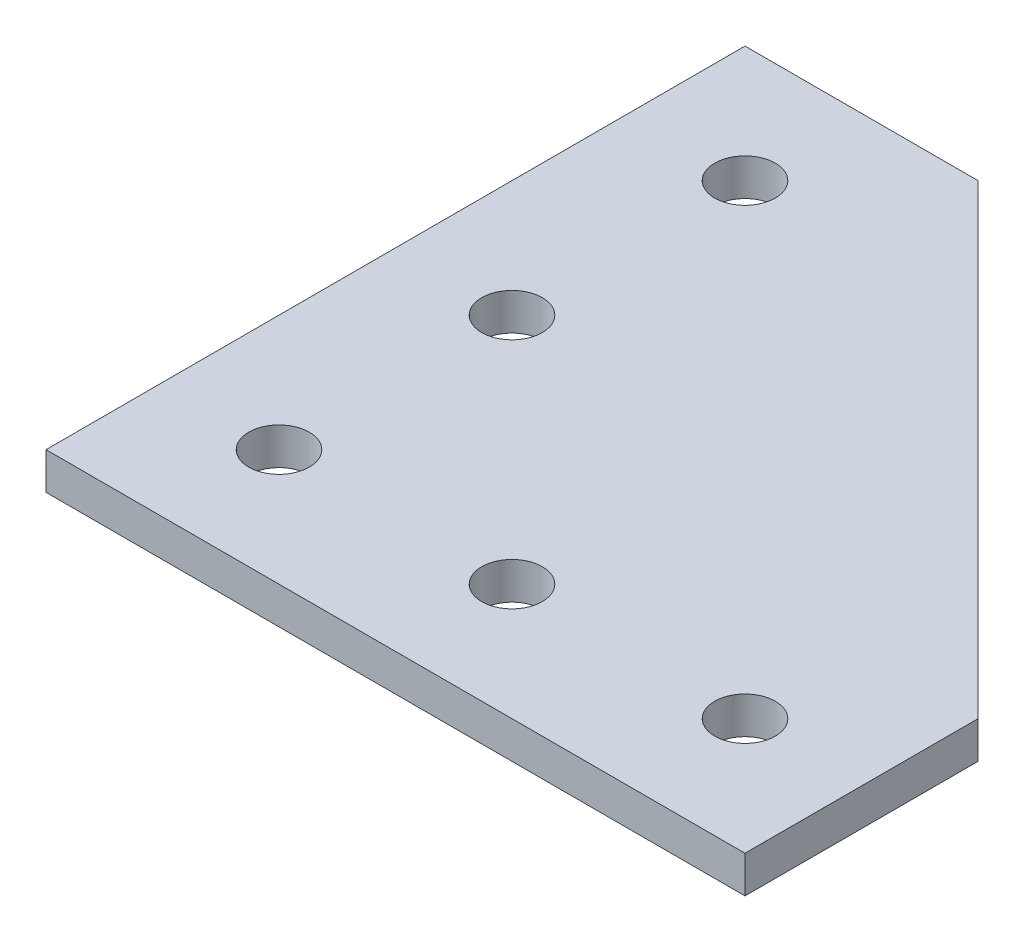
ISO-10303-21;
HEADER;
FILE_DESCRIPTION(('STEP AP214'),'2;1');
FILE_NAME('part.step','',(''),(''),'','','');
FILE_SCHEMA(('AUTOMOTIVE_DESIGN { 1 0 10303 214 1 1 1 1 }'));
ENDSEC;
DATA;
#1=APPLICATION_CONTEXT('core data for automotive mechanical design processes');
#2=APPLICATION_PROTOCOL_DEFINITION('international standard','automotive_design',2000,#1);
#3=PRODUCT_CONTEXT('',#1,'mechanical');
#4=PRODUCT('Part','Part','',(#3));
#5=PRODUCT_RELATED_PRODUCT_CATEGORY('part','',(#4));
#6=PRODUCT_DEFINITION_FORMATION('','',#4);
#7=PRODUCT_DEFINITION_CONTEXT('part definition',#1,'design');
#8=PRODUCT_DEFINITION('design','',#6,#7);
#9=PRODUCT_DEFINITION_SHAPE('','',#8);
#10=(LENGTH_UNIT() NAMED_UNIT(*) SI_UNIT(.MILLI.,.METRE.));
#11=(NAMED_UNIT(*) PLANE_ANGLE_UNIT() SI_UNIT($,.RADIAN.));
#12=(NAMED_UNIT(*) SI_UNIT($,.STERADIAN.) SOLID_ANGLE_UNIT());
#13=UNCERTAINTY_MEASURE_WITH_UNIT(LENGTH_MEASURE(1.E-05),#10,'distance_accuracy_value','');
#14=(GEOMETRIC_REPRESENTATION_CONTEXT(3) GLOBAL_UNCERTAINTY_ASSIGNED_CONTEXT((#13)) GLOBAL_UNIT_ASSIGNED_CONTEXT((#10,
#11,#12)) REPRESENTATION_CONTEXT('',''));
#15=CARTESIAN_POINT('',(0.,0.,0.));
#16=DIRECTION('',(0.,0.,1.));
#17=DIRECTION('',(1.,0.,0.));
#18=AXIS2_PLACEMENT_3D('',#15,#16,#17);
#19=CARTESIAN_POINT('',(0.,3.175,0.));
#20=DIRECTION('',(0.,1.,0.));
#21=DIRECTION('',(0.,0.,1.));
#22=AXIS2_PLACEMENT_3D('',#19,#20,#21);
#23=PLANE('',#22);
#24=CARTESIAN_POINT('',(10.,3.175,-10.));
#25=DIRECTION('',(0.,1.,0.));
#26=DIRECTION('',(0.,0.,1.));
#27=AXIS2_PLACEMENT_3D('',#24,#25,#26);
#28=CIRCLE('',#27,2.59999999999999);
#29=CARTESIAN_POINT('',(10.,3.175,-7.40000000000004));
#30=VERTEX_POINT('',#29);
#31=EDGE_CURVE('E179',#30,#30,#28,.T.);
#32=ORIENTED_EDGE('',*,*,#31,.F.);
#33=EDGE_LOOP('',(#32));
#34=FACE_BOUND('',#33,.T.);
#35=CARTESIAN_POINT('',(10.0000000000002,3.175,-49.9999999999998));
#36=DIRECTION('',(0.,1.,0.));
#37=DIRECTION('',(0.,0.,1.));
#38=AXIS2_PLACEMENT_3D('',#35,#36,#37);
#39=CIRCLE('',#38,2.59999999999998);
#40=CARTESIAN_POINT('',(10.0000000000002,3.175,-47.3999999999998));
#41=VERTEX_POINT('',#40);
#42=EDGE_CURVE('E191',#41,#41,#39,.T.);
#43=ORIENTED_EDGE('',*,*,#42,.F.);
#44=EDGE_LOOP('',(#43));
#45=FACE_BOUND('',#44,.T.);
#46=DIRECTION('',(1.,0.,0.));
#47=VECTOR('',#46,1.);
#48=CARTESIAN_POINT('',(1.80411241501588E-13,3.175,0.));
#49=LINE('',#48,#47);
#50=CARTESIAN_POINT('',(1.80411241501588E-13,3.175,0.));
#51=VERTEX_POINT('',#50);
#52=CARTESIAN_POINT('',(60.,3.175,0.));
#53=VERTEX_POINT('',#52);
#54=EDGE_CURVE('E119',#51,#53,#49,.T.);
#55=ORIENTED_EDGE('',*,*,#54,.T.);
#56=DIRECTION('',(0.,0.,-1.));
#57=VECTOR('',#56,1.);
#58=CARTESIAN_POINT('',(60.,3.175,0.));
#59=LINE('',#58,#57);
#60=CARTESIAN_POINT('',(59.9999999999997,3.175,-20.0000000000005));
#61=VERTEX_POINT('',#60);
#62=EDGE_CURVE('E85',#53,#61,#59,.T.);
#63=ORIENTED_EDGE('',*,*,#62,.T.);
#64=DIRECTION('',(-0.707106781186545,0.,-0.70710678118655));
#65=VECTOR('',#64,1.);
#66=CARTESIAN_POINT('',(59.9999999999997,3.175,-20.0000000000005));
#67=LINE('',#66,#65);
#68=CARTESIAN_POINT('',(20.0000000000005,3.175,-60.));
#69=VERTEX_POINT('',#68);
#70=EDGE_CURVE('E89',#61,#69,#67,.T.);
#71=ORIENTED_EDGE('',*,*,#70,.T.);
#72=DIRECTION('',(-1.,0.,0.));
#73=VECTOR('',#72,1.);
#74=CARTESIAN_POINT('',(0.,3.175,-60.));
#75=LINE('',#74,#73);
#76=CARTESIAN_POINT('',(0.,3.175,-60.));
#77=VERTEX_POINT('',#76);
#78=EDGE_CURVE('E93',#69,#77,#75,.T.);
#79=ORIENTED_EDGE('',*,*,#78,.T.);
#80=DIRECTION('',(0.,0.,1.));
#81=VECTOR('',#80,1.);
#82=CARTESIAN_POINT('',(1.80411241501588E-13,3.175,0.));
#83=LINE('',#82,#81);
#84=EDGE_CURVE('E51',#77,#51,#83,.T.);
#85=ORIENTED_EDGE('',*,*,#84,.T.);
#86=EDGE_LOOP('',(#55,#63,#71,#79,#85));
#87=FACE_BOUND('',#86,.T.);
#88=CARTESIAN_POINT('',(49.9999999999999,3.175,-9.99999999999983));
#89=DIRECTION('',(0.,1.,0.));
#90=DIRECTION('',(0.,0.,1.));
#91=AXIS2_PLACEMENT_3D('',#88,#89,#90);
#92=CIRCLE('',#91,2.59999999999999);
#93=CARTESIAN_POINT('',(49.9999999999999,3.175,-7.39999999999984));
#94=VERTEX_POINT('',#93);
#95=EDGE_CURVE('E113',#94,#94,#92,.T.);
#96=ORIENTED_EDGE('',*,*,#95,.F.);
#97=EDGE_LOOP('',(#96));
#98=FACE_BOUND('',#97,.T.);
#99=CARTESIAN_POINT('',(30.,3.175,-9.99999999999992));
#100=DIRECTION('',(0.,1.,0.));
#101=DIRECTION('',(0.,0.,1.));
#102=AXIS2_PLACEMENT_3D('',#99,#100,#101);
#103=CIRCLE('',#102,2.59999999999999);
#104=CARTESIAN_POINT('',(30.,3.175,-7.39999999999993));
#105=VERTEX_POINT('',#104);
#106=EDGE_CURVE('E185',#105,#105,#103,.T.);
#107=ORIENTED_EDGE('',*,*,#106,.F.);
#108=EDGE_LOOP('',(#107));
#109=FACE_BOUND('',#108,.T.);
#110=CARTESIAN_POINT('',(10.0000000000003,3.175,-29.9999999999997));
#111=DIRECTION('',(0.,1.,0.));
#112=DIRECTION('',(0.,0.,1.));
#113=AXIS2_PLACEMENT_3D('',#110,#111,#112);
#114=CIRCLE('',#113,2.59999999999999);
#115=CARTESIAN_POINT('',(10.0000000000003,3.175,-27.3999999999997));
#116=VERTEX_POINT('',#115);
#117=EDGE_CURVE('E170',#116,#116,#114,.T.);
#118=ORIENTED_EDGE('',*,*,#117,.F.);
#119=EDGE_LOOP('',(#118));
#120=FACE_BOUND('',#119,.T.);
#121=ADVANCED_FACE('F34',(#34,#45,#87,#98,#109,#120),#23,.T.);
#122=CARTESIAN_POINT('',(0.,0.,0.));
#123=DIRECTION('',(0.,1.,0.));
#124=DIRECTION('',(0.,0.,1.));
#125=AXIS2_PLACEMENT_3D('',#122,#123,#124);
#126=PLANE('',#125);
#127=CARTESIAN_POINT('',(10.,0.,-10.));
#128=DIRECTION('',(0.,1.,0.));
#129=DIRECTION('',(0.,0.,1.));
#130=AXIS2_PLACEMENT_3D('',#127,#128,#129);
#131=CIRCLE('',#130,2.59999999999999);
#132=CARTESIAN_POINT('',(10.,0.,-7.40000000000004));
#133=VERTEX_POINT('',#132);
#134=EDGE_CURVE('E176',#133,#133,#131,.T.);
#135=ORIENTED_EDGE('',*,*,#134,.T.);
#136=EDGE_LOOP('',(#135));
#137=FACE_BOUND('',#136,.T.);
#138=CARTESIAN_POINT('',(10.0000000000002,0.,-49.9999999999998));
#139=DIRECTION('',(0.,1.,0.));
#140=DIRECTION('',(0.,0.,1.));
#141=AXIS2_PLACEMENT_3D('',#138,#139,#140);
#142=CIRCLE('',#141,2.59999999999998);
#143=CARTESIAN_POINT('',(10.0000000000002,0.,-47.3999999999998));
#144=VERTEX_POINT('',#143);
#145=EDGE_CURVE('E188',#144,#144,#142,.T.);
#146=ORIENTED_EDGE('',*,*,#145,.T.);
#147=EDGE_LOOP('',(#146));
#148=FACE_BOUND('',#147,.T.);
#149=DIRECTION('',(1.,0.,0.));
#150=VECTOR('',#149,1.);
#151=CARTESIAN_POINT('',(1.80411241501588E-13,0.,0.));
#152=LINE('',#151,#150);
#153=CARTESIAN_POINT('',(1.80411241501588E-13,0.,0.));
#154=VERTEX_POINT('',#153);
#155=CARTESIAN_POINT('',(60.,0.,0.));
#156=VERTEX_POINT('',#155);
#157=EDGE_CURVE('E109',#154,#156,#152,.T.);
#158=ORIENTED_EDGE('',*,*,#157,.F.);
#159=DIRECTION('',(0.,0.,1.));
#160=VECTOR('',#159,1.);
#161=CARTESIAN_POINT('',(1.80411241501588E-13,0.,0.));
#162=LINE('',#161,#160);
#163=CARTESIAN_POINT('',(0.,0.,-60.));
#164=VERTEX_POINT('',#163);
#165=EDGE_CURVE('E77',#164,#154,#162,.T.);
#166=ORIENTED_EDGE('',*,*,#165,.F.);
#167=DIRECTION('',(-1.,0.,0.));
#168=VECTOR('',#167,1.);
#169=CARTESIAN_POINT('',(0.,0.,-60.));
#170=LINE('',#169,#168);
#171=CARTESIAN_POINT('',(20.0000000000005,0.,-60.));
#172=VERTEX_POINT('',#171);
#173=EDGE_CURVE('E71',#172,#164,#170,.T.);
#174=ORIENTED_EDGE('',*,*,#173,.F.);
#175=DIRECTION('',(-0.707106781186545,0.,-0.70710678118655));
#176=VECTOR('',#175,1.);
#177=CARTESIAN_POINT('',(59.9999999999997,0.,-20.0000000000005));
#178=LINE('',#177,#176);
#179=CARTESIAN_POINT('',(59.9999999999997,0.,-20.0000000000005));
#180=VERTEX_POINT('',#179);
#181=EDGE_CURVE('E100',#180,#172,#178,.T.);
#182=ORIENTED_EDGE('',*,*,#181,.F.);
#183=DIRECTION('',(0.,0.,-1.));
#184=VECTOR('',#183,1.);
#185=CARTESIAN_POINT('',(60.,0.,0.));
#186=LINE('',#185,#184);
#187=EDGE_CURVE('E112',#156,#180,#186,.T.);
#188=ORIENTED_EDGE('',*,*,#187,.F.);
#189=EDGE_LOOP('',(#158,#166,#174,#182,#188));
#190=FACE_BOUND('',#189,.T.);
#191=CARTESIAN_POINT('',(49.9999999999999,0.,-9.99999999999983));
#192=DIRECTION('',(0.,1.,0.));
#193=DIRECTION('',(0.,0.,1.));
#194=AXIS2_PLACEMENT_3D('',#191,#192,#193);
#195=CIRCLE('',#194,2.59999999999999);
#196=CARTESIAN_POINT('',(49.9999999999999,0.,-7.39999999999984));
#197=VERTEX_POINT('',#196);
#198=EDGE_CURVE('E194',#197,#197,#195,.T.);
#199=ORIENTED_EDGE('',*,*,#198,.T.);
#200=EDGE_LOOP('',(#199));
#201=FACE_BOUND('',#200,.T.);
#202=CARTESIAN_POINT('',(30.,0.,-9.99999999999992));
#203=DIRECTION('',(0.,1.,0.));
#204=DIRECTION('',(0.,0.,1.));
#205=AXIS2_PLACEMENT_3D('',#202,#203,#204);
#206=CIRCLE('',#205,2.59999999999999);
#207=CARTESIAN_POINT('',(30.,0.,-7.39999999999993));
#208=VERTEX_POINT('',#207);
#209=EDGE_CURVE('E182',#208,#208,#206,.T.);
#210=ORIENTED_EDGE('',*,*,#209,.T.);
#211=EDGE_LOOP('',(#210));
#212=FACE_BOUND('',#211,.T.);
#213=CARTESIAN_POINT('',(10.0000000000003,0.,-29.9999999999997));
#214=DIRECTION('',(0.,1.,0.));
#215=DIRECTION('',(0.,0.,1.));
#216=AXIS2_PLACEMENT_3D('',#213,#214,#215);
#217=CIRCLE('',#216,2.59999999999999);
#218=CARTESIAN_POINT('',(10.0000000000003,0.,-27.3999999999997));
#219=VERTEX_POINT('',#218);
#220=EDGE_CURVE('E173',#219,#219,#217,.T.);
#221=ORIENTED_EDGE('',*,*,#220,.T.);
#222=EDGE_LOOP('',(#221));
#223=FACE_BOUND('',#222,.T.);
#224=ADVANCED_FACE('F123',(#137,#148,#190,#201,#212,#223),#126,.F.);
#225=CARTESIAN_POINT('',(1.80411241501588E-13,3.175,0.));
#226=DIRECTION('',(0.,0.,-1.));
#227=DIRECTION('',(-1.,0.,0.));
#228=AXIS2_PLACEMENT_3D('',#225,#226,#227);
#229=PLANE('',#228);
#230=ORIENTED_EDGE('',*,*,#157,.T.);
#231=DIRECTION('',(0.,-1.,0.));
#232=VECTOR('',#231,1.);
#233=CARTESIAN_POINT('',(60.,3.175,0.));
#234=LINE('',#233,#232);
#235=EDGE_CURVE('E11',#53,#156,#234,.T.);
#236=ORIENTED_EDGE('',*,*,#235,.F.);
#237=ORIENTED_EDGE('',*,*,#54,.F.);
#238=DIRECTION('',(0.,-1.,0.));
#239=VECTOR('',#238,1.);
#240=CARTESIAN_POINT('',(1.80411241501588E-13,3.175,0.));
#241=LINE('',#240,#239);
#242=EDGE_CURVE('E105',#51,#154,#241,.T.);
#243=ORIENTED_EDGE('',*,*,#242,.T.);
#244=EDGE_LOOP('',(#230,#236,#237,#243));
#245=FACE_BOUND('',#244,.T.);
#246=ADVANCED_FACE('F36',(#245),#229,.F.);
#247=CARTESIAN_POINT('',(60.,3.175,0.));
#248=DIRECTION('',(-1.,0.,0.));
#249=DIRECTION('',(0.,0.,1.));
#250=AXIS2_PLACEMENT_3D('',#247,#248,#249);
#251=PLANE('',#250);
#252=ORIENTED_EDGE('',*,*,#187,.T.);
#253=DIRECTION('',(0.,-1.,0.));
#254=VECTOR('',#253,1.);
#255=CARTESIAN_POINT('',(59.9999999999997,3.175,-20.0000000000005));
#256=LINE('',#255,#254);
#257=EDGE_CURVE('E43',#61,#180,#256,.T.);
#258=ORIENTED_EDGE('',*,*,#257,.F.);
#259=ORIENTED_EDGE('',*,*,#62,.F.);
#260=ORIENTED_EDGE('',*,*,#235,.T.);
#261=EDGE_LOOP('',(#252,#258,#259,#260));
#262=FACE_BOUND('',#261,.T.);
#263=ADVANCED_FACE('F218',(#262),#251,.F.);
#264=CARTESIAN_POINT('',(59.9999999999997,3.175,-20.0000000000005));
#265=DIRECTION('',(-0.70710678118655,0.,0.707106781186545));
#266=DIRECTION('',(0.707106781186545,0.,0.70710678118655));
#267=AXIS2_PLACEMENT_3D('',#264,#265,#266);
#268=PLANE('',#267);
#269=ORIENTED_EDGE('',*,*,#181,.T.);
#270=DIRECTION('',(0.,-1.,0.));
#271=VECTOR('',#270,1.);
#272=CARTESIAN_POINT('',(20.0000000000005,3.175,-60.));
#273=LINE('',#272,#271);
#274=EDGE_CURVE('E97',#69,#172,#273,.T.);
#275=ORIENTED_EDGE('',*,*,#274,.F.);
#276=ORIENTED_EDGE('',*,*,#70,.F.);
#277=ORIENTED_EDGE('',*,*,#257,.T.);
#278=EDGE_LOOP('',(#269,#275,#276,#277));
#279=FACE_BOUND('',#278,.T.);
#280=ADVANCED_FACE('F98',(#279),#268,.F.);
#281=CARTESIAN_POINT('',(0.,3.175,-60.));
#282=DIRECTION('',(0.,0.,1.));
#283=DIRECTION('',(1.,0.,0.));
#284=AXIS2_PLACEMENT_3D('',#281,#282,#283);
#285=PLANE('',#284);
#286=ORIENTED_EDGE('',*,*,#173,.T.);
#287=DIRECTION('',(0.,-1.,0.));
#288=VECTOR('',#287,1.);
#289=CARTESIAN_POINT('',(0.,3.175,-60.));
#290=LINE('',#289,#288);
#291=EDGE_CURVE('E101',#77,#164,#290,.T.);
#292=ORIENTED_EDGE('',*,*,#291,.F.);
#293=ORIENTED_EDGE('',*,*,#78,.F.);
#294=ORIENTED_EDGE('',*,*,#274,.T.);
#295=EDGE_LOOP('',(#286,#292,#293,#294));
#296=FACE_BOUND('',#295,.T.);
#297=ADVANCED_FACE('F103',(#296),#285,.F.);
#298=CARTESIAN_POINT('',(1.80411241501588E-13,3.175,0.));
#299=DIRECTION('',(1.,0.,0.));
#300=DIRECTION('',(0.,0.,-1.));
#301=AXIS2_PLACEMENT_3D('',#298,#299,#300);
#302=PLANE('',#301);
#303=ORIENTED_EDGE('',*,*,#165,.T.);
#304=ORIENTED_EDGE('',*,*,#242,.F.);
#305=ORIENTED_EDGE('',*,*,#84,.F.);
#306=ORIENTED_EDGE('',*,*,#291,.T.);
#307=EDGE_LOOP('',(#303,#304,#305,#306));
#308=FACE_BOUND('',#307,.T.);
#309=ADVANCED_FACE('F128',(#308),#302,.F.);
#310=CARTESIAN_POINT('',(49.9999999999999,3.175,-9.99999999999983));
#311=DIRECTION('',(0.,-1.,0.));
#312=DIRECTION('',(0.,0.,-1.));
#313=AXIS2_PLACEMENT_3D('',#310,#311,#312);
#314=CYLINDRICAL_SURFACE('',#313,2.59999999999999);
#315=ORIENTED_EDGE('',*,*,#95,.T.);
#316=EDGE_LOOP('',(#315));
#317=FACE_BOUND('',#316,.T.);
#318=ORIENTED_EDGE('',*,*,#198,.F.);
#319=EDGE_LOOP('',(#318));
#320=FACE_BOUND('',#319,.T.);
#321=ADVANCED_FACE('F130',(#317,#320),#314,.F.);
#322=CARTESIAN_POINT('',(10.0000000000002,3.175,-49.9999999999998));
#323=DIRECTION('',(0.,-1.,0.));
#324=DIRECTION('',(0.,0.,-1.));
#325=AXIS2_PLACEMENT_3D('',#322,#323,#324);
#326=CYLINDRICAL_SURFACE('',#325,2.59999999999998);
#327=ORIENTED_EDGE('',*,*,#42,.T.);
#328=EDGE_LOOP('',(#327));
#329=FACE_BOUND('',#328,.T.);
#330=ORIENTED_EDGE('',*,*,#145,.F.);
#331=EDGE_LOOP('',(#330));
#332=FACE_BOUND('',#331,.T.);
#333=ADVANCED_FACE('F136',(#329,#332),#326,.F.);
#334=CARTESIAN_POINT('',(30.,3.175,-9.99999999999992));
#335=DIRECTION('',(0.,-1.,0.));
#336=DIRECTION('',(0.,0.,-1.));
#337=AXIS2_PLACEMENT_3D('',#334,#335,#336);
#338=CYLINDRICAL_SURFACE('',#337,2.59999999999999);
#339=ORIENTED_EDGE('',*,*,#106,.T.);
#340=EDGE_LOOP('',(#339));
#341=FACE_BOUND('',#340,.T.);
#342=ORIENTED_EDGE('',*,*,#209,.F.);
#343=EDGE_LOOP('',(#342));
#344=FACE_BOUND('',#343,.T.);
#345=ADVANCED_FACE('F153',(#341,#344),#338,.F.);
#346=CARTESIAN_POINT('',(10.,3.175,-10.));
#347=DIRECTION('',(0.,-1.,0.));
#348=DIRECTION('',(0.,0.,-1.));
#349=AXIS2_PLACEMENT_3D('',#346,#347,#348);
#350=CYLINDRICAL_SURFACE('',#349,2.59999999999999);
#351=ORIENTED_EDGE('',*,*,#31,.T.);
#352=EDGE_LOOP('',(#351));
#353=FACE_BOUND('',#352,.T.);
#354=ORIENTED_EDGE('',*,*,#134,.F.);
#355=EDGE_LOOP('',(#354));
#356=FACE_BOUND('',#355,.T.);
#357=ADVANCED_FACE('F157',(#353,#356),#350,.F.);
#358=CARTESIAN_POINT('',(10.0000000000003,3.175,-29.9999999999997));
#359=DIRECTION('',(0.,-1.,0.));
#360=DIRECTION('',(0.,0.,-1.));
#361=AXIS2_PLACEMENT_3D('',#358,#359,#360);
#362=CYLINDRICAL_SURFACE('',#361,2.59999999999999);
#363=ORIENTED_EDGE('',*,*,#117,.T.);
#364=EDGE_LOOP('',(#363));
#365=FACE_BOUND('',#364,.T.);
#366=ORIENTED_EDGE('',*,*,#220,.F.);
#367=EDGE_LOOP('',(#366));
#368=FACE_BOUND('',#367,.T.);
#369=ADVANCED_FACE('F161',(#365,#368),#362,.F.);
#370=CLOSED_SHELL('',(#121,#224,#246,#263,#280,#297,#309,#321,#333,#345,#357,#369));
#371=MANIFOLD_SOLID_BREP('B2',#370);
#372=ADVANCED_BREP_SHAPE_REPRESENTATION('',(#18,#371),#14);
#373=SHAPE_DEFINITION_REPRESENTATION(#9,#372);
ENDSEC;
END-ISO-10303-21;
